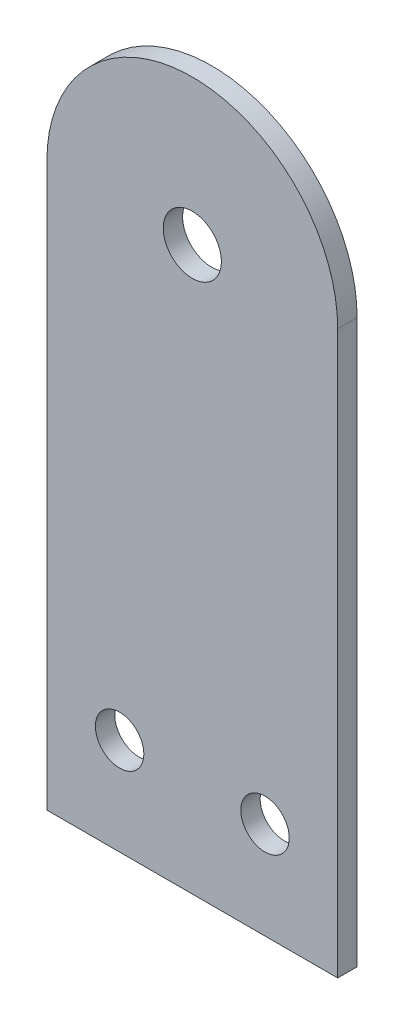
ISO-10303-21;
HEADER;
FILE_DESCRIPTION(('STEP AP214'),'2;1');
FILE_NAME('part.step','',(''),(''),'','','');
FILE_SCHEMA(('AUTOMOTIVE_DESIGN { 1 0 10303 214 1 1 1 1 }'));
ENDSEC;
DATA;
#1=APPLICATION_CONTEXT('core data for automotive mechanical design processes');
#2=APPLICATION_PROTOCOL_DEFINITION('international standard','automotive_design',2000,#1);
#3=PRODUCT_CONTEXT('',#1,'mechanical');
#4=PRODUCT('Part','Part','',(#3));
#5=PRODUCT_RELATED_PRODUCT_CATEGORY('part','',(#4));
#6=PRODUCT_DEFINITION_FORMATION('','',#4);
#7=PRODUCT_DEFINITION_CONTEXT('part definition',#1,'design');
#8=PRODUCT_DEFINITION('design','',#6,#7);
#9=PRODUCT_DEFINITION_SHAPE('','',#8);
#10=(LENGTH_UNIT() NAMED_UNIT(*) SI_UNIT(.MILLI.,.METRE.));
#11=(NAMED_UNIT(*) PLANE_ANGLE_UNIT() SI_UNIT($,.RADIAN.));
#12=(NAMED_UNIT(*) SI_UNIT($,.STERADIAN.) SOLID_ANGLE_UNIT());
#13=UNCERTAINTY_MEASURE_WITH_UNIT(LENGTH_MEASURE(1.E-05),#10,'distance_accuracy_value','');
#14=(GEOMETRIC_REPRESENTATION_CONTEXT(3) GLOBAL_UNCERTAINTY_ASSIGNED_CONTEXT((#13)) GLOBAL_UNIT_ASSIGNED_CONTEXT((#10,
#11,#12)) REPRESENTATION_CONTEXT('',''));
#15=CARTESIAN_POINT('',(0.,0.,0.));
#16=DIRECTION('',(0.,0.,1.));
#17=DIRECTION('',(1.,0.,0.));
#18=AXIS2_PLACEMENT_3D('',#15,#16,#17);
#19=CARTESIAN_POINT('',(0.,58.,2.));
#20=DIRECTION('',(1.,0.,0.));
#21=DIRECTION('',(0.,0.,-1.));
#22=AXIS2_PLACEMENT_3D('',#19,#20,#21);
#23=PLANE('',#22);
#24=DIRECTION('',(0.,-1.,0.));
#25=VECTOR('',#24,1.);
#26=CARTESIAN_POINT('',(0.,58.,0.));
#27=LINE('',#26,#25);
#28=CARTESIAN_POINT('',(0.,58.,0.));
#29=VERTEX_POINT('',#28);
#30=CARTESIAN_POINT('',(0.,0.,0.));
#31=VERTEX_POINT('',#30);
#32=EDGE_CURVE('E100',#29,#31,#27,.T.);
#33=ORIENTED_EDGE('',*,*,#32,.T.);
#34=DIRECTION('',(0.,0.,-1.));
#35=VECTOR('',#34,1.);
#36=CARTESIAN_POINT('',(0.,0.,2.));
#37=LINE('',#36,#35);
#38=CARTESIAN_POINT('',(0.,0.,2.));
#39=VERTEX_POINT('',#38);
#40=EDGE_CURVE('E11',#39,#31,#37,.T.);
#41=ORIENTED_EDGE('',*,*,#40,.F.);
#42=DIRECTION('',(0.,-1.,0.));
#43=VECTOR('',#42,1.);
#44=CARTESIAN_POINT('',(0.,58.,2.));
#45=LINE('',#44,#43);
#46=CARTESIAN_POINT('',(0.,58.,2.));
#47=VERTEX_POINT('',#46);
#48=EDGE_CURVE('E88',#47,#39,#45,.T.);
#49=ORIENTED_EDGE('',*,*,#48,.F.);
#50=DIRECTION('',(0.,0.,-1.));
#51=VECTOR('',#50,1.);
#52=CARTESIAN_POINT('',(0.,58.,2.));
#53=LINE('',#52,#51);
#54=EDGE_CURVE('E96',#47,#29,#53,.T.);
#55=ORIENTED_EDGE('',*,*,#54,.T.);
#56=EDGE_LOOP('',(#33,#41,#49,#55));
#57=FACE_BOUND('',#56,.T.);
#58=ADVANCED_FACE('F37',(#57),#23,.F.);
#59=CARTESIAN_POINT('',(0.,0.,2.));
#60=DIRECTION('',(0.,1.,0.));
#61=DIRECTION('',(0.,0.,1.));
#62=AXIS2_PLACEMENT_3D('',#59,#60,#61);
#63=PLANE('',#62);
#64=DIRECTION('',(1.,0.,0.));
#65=VECTOR('',#64,1.);
#66=CARTESIAN_POINT('',(0.,0.,0.));
#67=LINE('',#66,#65);
#68=CARTESIAN_POINT('',(30.,0.,0.));
#69=VERTEX_POINT('',#68);
#70=EDGE_CURVE('E92',#31,#69,#67,.T.);
#71=ORIENTED_EDGE('',*,*,#70,.T.);
#72=DIRECTION('',(0.,0.,-1.));
#73=VECTOR('',#72,1.);
#74=CARTESIAN_POINT('',(30.,0.,2.));
#75=LINE('',#74,#73);
#76=CARTESIAN_POINT('',(30.,0.,2.));
#77=VERTEX_POINT('',#76);
#78=EDGE_CURVE('E45',#77,#69,#75,.T.);
#79=ORIENTED_EDGE('',*,*,#78,.F.);
#80=DIRECTION('',(1.,0.,0.));
#81=VECTOR('',#80,1.);
#82=CARTESIAN_POINT('',(0.,0.,2.));
#83=LINE('',#82,#81);
#84=EDGE_CURVE('E83',#39,#77,#83,.T.);
#85=ORIENTED_EDGE('',*,*,#84,.F.);
#86=ORIENTED_EDGE('',*,*,#40,.T.);
#87=EDGE_LOOP('',(#71,#79,#85,#86));
#88=FACE_BOUND('',#87,.T.);
#89=ADVANCED_FACE('F91',(#88),#63,.F.);
#90=CARTESIAN_POINT('',(30.,0.,2.));
#91=DIRECTION('',(-1.,0.,0.));
#92=DIRECTION('',(0.,0.,1.));
#93=AXIS2_PLACEMENT_3D('',#90,#91,#92);
#94=PLANE('',#93);
#95=DIRECTION('',(0.,1.,0.));
#96=VECTOR('',#95,1.);
#97=CARTESIAN_POINT('',(30.,0.,0.));
#98=LINE('',#97,#96);
#99=CARTESIAN_POINT('',(30.,58.,0.));
#100=VERTEX_POINT('',#99);
#101=EDGE_CURVE('E70',#69,#100,#98,.T.);
#102=ORIENTED_EDGE('',*,*,#101,.T.);
#103=DIRECTION('',(0.,0.,-1.));
#104=VECTOR('',#103,1.);
#105=CARTESIAN_POINT('',(30.,58.,2.));
#106=LINE('',#105,#104);
#107=CARTESIAN_POINT('',(30.,58.,2.));
#108=VERTEX_POINT('',#107);
#109=EDGE_CURVE('E93',#108,#100,#106,.T.);
#110=ORIENTED_EDGE('',*,*,#109,.F.);
#111=DIRECTION('',(0.,1.,0.));
#112=VECTOR('',#111,1.);
#113=CARTESIAN_POINT('',(30.,0.,2.));
#114=LINE('',#113,#112);
#115=EDGE_CURVE('E86',#77,#108,#114,.T.);
#116=ORIENTED_EDGE('',*,*,#115,.F.);
#117=ORIENTED_EDGE('',*,*,#78,.T.);
#118=EDGE_LOOP('',(#102,#110,#116,#117));
#119=FACE_BOUND('',#118,.T.);
#120=ADVANCED_FACE('F94',(#119),#94,.F.);
#121=CARTESIAN_POINT('',(15.,58.,2.));
#122=DIRECTION('',(0.,0.,-1.));
#123=DIRECTION('',(-1.,0.,0.));
#124=AXIS2_PLACEMENT_3D('',#121,#122,#123);
#125=CYLINDRICAL_SURFACE('',#124,15.);
#126=CARTESIAN_POINT('',(15.,58.,0.));
#127=DIRECTION('',(0.,0.,1.));
#128=DIRECTION('',(1.,0.,0.));
#129=AXIS2_PLACEMENT_3D('',#126,#127,#128);
#130=CIRCLE('',#129,15.);
#131=EDGE_CURVE('E76',#100,#29,#130,.T.);
#132=ORIENTED_EDGE('',*,*,#131,.T.);
#133=ORIENTED_EDGE('',*,*,#54,.F.);
#134=CARTESIAN_POINT('',(15.,58.,2.));
#135=DIRECTION('',(0.,0.,1.));
#136=DIRECTION('',(1.,0.,0.));
#137=AXIS2_PLACEMENT_3D('',#134,#135,#136);
#138=CIRCLE('',#137,15.);
#139=EDGE_CURVE('E53',#108,#47,#138,.T.);
#140=ORIENTED_EDGE('',*,*,#139,.F.);
#141=ORIENTED_EDGE('',*,*,#109,.T.);
#142=EDGE_LOOP('',(#132,#133,#140,#141));
#143=FACE_BOUND('',#142,.T.);
#144=ADVANCED_FACE('F108',(#143),#125,.T.);
#145=CARTESIAN_POINT('',(15.,58.,2.));
#146=DIRECTION('',(0.,0.,1.));
#147=DIRECTION('',(1.,0.,0.));
#148=AXIS2_PLACEMENT_3D('',#145,#146,#147);
#149=PLANE('',#148);
#150=CARTESIAN_POINT('',(7.5,10.,2.));
#151=DIRECTION('',(0.,0.,1.));
#152=DIRECTION('',(1.,0.,0.));
#153=AXIS2_PLACEMENT_3D('',#150,#151,#152);
#154=CIRCLE('',#153,2.5);
#155=CARTESIAN_POINT('',(9.99999999999999,10.,2.));
#156=VERTEX_POINT('',#155);
#157=EDGE_CURVE('E126',#156,#156,#154,.T.);
#158=ORIENTED_EDGE('',*,*,#157,.F.);
#159=EDGE_LOOP('',(#158));
#160=FACE_BOUND('',#159,.T.);
#161=CARTESIAN_POINT('',(15.,58.,2.));
#162=DIRECTION('',(0.,0.,1.));
#163=DIRECTION('',(1.,0.,0.));
#164=AXIS2_PLACEMENT_3D('',#161,#162,#163);
#165=CIRCLE('',#164,3.);
#166=CARTESIAN_POINT('',(18.,58.,2.));
#167=VERTEX_POINT('',#166);
#168=EDGE_CURVE('E120',#167,#167,#165,.T.);
#169=ORIENTED_EDGE('',*,*,#168,.F.);
#170=EDGE_LOOP('',(#169));
#171=FACE_BOUND('',#170,.T.);
#172=CARTESIAN_POINT('',(22.5,10.,2.));
#173=DIRECTION('',(0.,0.,1.));
#174=DIRECTION('',(1.,0.,0.));
#175=AXIS2_PLACEMENT_3D('',#172,#173,#174);
#176=CIRCLE('',#175,2.5);
#177=CARTESIAN_POINT('',(25.,10.,2.));
#178=VERTEX_POINT('',#177);
#179=EDGE_CURVE('E114',#178,#178,#176,.T.);
#180=ORIENTED_EDGE('',*,*,#179,.F.);
#181=EDGE_LOOP('',(#180));
#182=FACE_BOUND('',#181,.T.);
#183=ORIENTED_EDGE('',*,*,#48,.T.);
#184=ORIENTED_EDGE('',*,*,#84,.T.);
#185=ORIENTED_EDGE('',*,*,#115,.T.);
#186=ORIENTED_EDGE('',*,*,#139,.T.);
#187=EDGE_LOOP('',(#183,#184,#185,#186));
#188=FACE_BOUND('',#187,.T.);
#189=ADVANCED_FACE('F84',(#160,#171,#182,#188),#149,.T.);
#190=CARTESIAN_POINT('',(15.,58.,0.));
#191=DIRECTION('',(0.,0.,1.));
#192=DIRECTION('',(1.,0.,0.));
#193=AXIS2_PLACEMENT_3D('',#190,#191,#192);
#194=PLANE('',#193);
#195=CARTESIAN_POINT('',(7.5,10.,0.));
#196=DIRECTION('',(0.,0.,1.));
#197=DIRECTION('',(1.,0.,0.));
#198=AXIS2_PLACEMENT_3D('',#195,#196,#197);
#199=CIRCLE('',#198,2.5);
#200=CARTESIAN_POINT('',(9.99999999999999,10.,0.));
#201=VERTEX_POINT('',#200);
#202=EDGE_CURVE('E103',#201,#201,#199,.T.);
#203=ORIENTED_EDGE('',*,*,#202,.T.);
#204=EDGE_LOOP('',(#203));
#205=FACE_BOUND('',#204,.T.);
#206=CARTESIAN_POINT('',(15.,58.,0.));
#207=DIRECTION('',(0.,0.,1.));
#208=DIRECTION('',(1.,0.,0.));
#209=AXIS2_PLACEMENT_3D('',#206,#207,#208);
#210=CIRCLE('',#209,3.);
#211=CARTESIAN_POINT('',(18.,58.,0.));
#212=VERTEX_POINT('',#211);
#213=EDGE_CURVE('E123',#212,#212,#210,.T.);
#214=ORIENTED_EDGE('',*,*,#213,.T.);
#215=EDGE_LOOP('',(#214));
#216=FACE_BOUND('',#215,.T.);
#217=CARTESIAN_POINT('',(22.5,10.,0.));
#218=DIRECTION('',(0.,0.,1.));
#219=DIRECTION('',(1.,0.,0.));
#220=AXIS2_PLACEMENT_3D('',#217,#218,#219);
#221=CIRCLE('',#220,2.5);
#222=CARTESIAN_POINT('',(25.,10.,0.));
#223=VERTEX_POINT('',#222);
#224=EDGE_CURVE('E117',#223,#223,#221,.T.);
#225=ORIENTED_EDGE('',*,*,#224,.T.);
#226=EDGE_LOOP('',(#225));
#227=FACE_BOUND('',#226,.T.);
#228=ORIENTED_EDGE('',*,*,#32,.F.);
#229=ORIENTED_EDGE('',*,*,#131,.F.);
#230=ORIENTED_EDGE('',*,*,#101,.F.);
#231=ORIENTED_EDGE('',*,*,#70,.F.);
#232=EDGE_LOOP('',(#228,#229,#230,#231));
#233=FACE_BOUND('',#232,.T.);
#234=ADVANCED_FACE('F111',(#205,#216,#227,#233),#194,.F.);
#235=CARTESIAN_POINT('',(22.5,10.,0.));
#236=DIRECTION('',(0.,0.,1.));
#237=DIRECTION('',(1.,0.,0.));
#238=AXIS2_PLACEMENT_3D('',#235,#236,#237);
#239=CYLINDRICAL_SURFACE('',#238,2.5);
#240=ORIENTED_EDGE('',*,*,#224,.F.);
#241=EDGE_LOOP('',(#240));
#242=FACE_BOUND('',#241,.T.);
#243=ORIENTED_EDGE('',*,*,#179,.T.);
#244=EDGE_LOOP('',(#243));
#245=FACE_BOUND('',#244,.T.);
#246=ADVANCED_FACE('F148',(#242,#245),#239,.F.);
#247=CARTESIAN_POINT('',(15.,58.,0.));
#248=DIRECTION('',(0.,0.,1.));
#249=DIRECTION('',(1.,0.,0.));
#250=AXIS2_PLACEMENT_3D('',#247,#248,#249);
#251=CYLINDRICAL_SURFACE('',#250,3.);
#252=ORIENTED_EDGE('',*,*,#213,.F.);
#253=EDGE_LOOP('',(#252));
#254=FACE_BOUND('',#253,.T.);
#255=ORIENTED_EDGE('',*,*,#168,.T.);
#256=EDGE_LOOP('',(#255));
#257=FACE_BOUND('',#256,.T.);
#258=ADVANCED_FACE('F137',(#254,#257),#251,.F.);
#259=CARTESIAN_POINT('',(7.5,10.,0.));
#260=DIRECTION('',(0.,0.,1.));
#261=DIRECTION('',(1.,0.,0.));
#262=AXIS2_PLACEMENT_3D('',#259,#260,#261);
#263=CYLINDRICAL_SURFACE('',#262,2.5);
#264=ORIENTED_EDGE('',*,*,#202,.F.);
#265=EDGE_LOOP('',(#264));
#266=FACE_BOUND('',#265,.T.);
#267=ORIENTED_EDGE('',*,*,#157,.T.);
#268=EDGE_LOOP('',(#267));
#269=FACE_BOUND('',#268,.T.);
#270=ADVANCED_FACE('F134',(#266,#269),#263,.F.);
#271=CLOSED_SHELL('',(#58,#89,#120,#144,#189,#234,#246,#258,#270));
#272=MANIFOLD_SOLID_BREP('B2',#271);
#273=ADVANCED_BREP_SHAPE_REPRESENTATION('',(#18,#272),#14);
#274=SHAPE_DEFINITION_REPRESENTATION(#9,#273);
ENDSEC;
END-ISO-10303-21;
